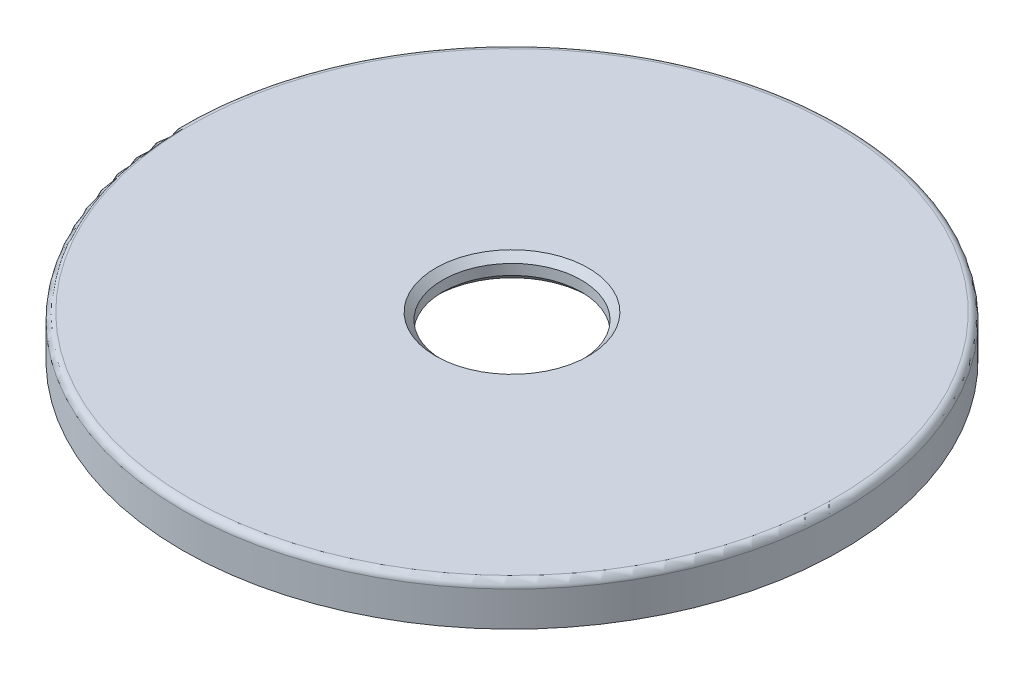
ISO-10303-21;
HEADER;
FILE_DESCRIPTION(('STEP AP214'),'2;1');
FILE_NAME('part.step','',(''),(''),'','','');
FILE_SCHEMA(('AUTOMOTIVE_DESIGN { 1 0 10303 214 1 1 1 1 }'));
ENDSEC;
DATA;
#1=APPLICATION_CONTEXT('core data for automotive mechanical design processes');
#2=APPLICATION_PROTOCOL_DEFINITION('international standard','automotive_design',2000,#1);
#3=PRODUCT_CONTEXT('',#1,'mechanical');
#4=PRODUCT('Part','Part','',(#3));
#5=PRODUCT_RELATED_PRODUCT_CATEGORY('part','',(#4));
#6=PRODUCT_DEFINITION_FORMATION('','',#4);
#7=PRODUCT_DEFINITION_CONTEXT('part definition',#1,'design');
#8=PRODUCT_DEFINITION('design','',#6,#7);
#9=PRODUCT_DEFINITION_SHAPE('','',#8);
#10=(LENGTH_UNIT() NAMED_UNIT(*) SI_UNIT(.MILLI.,.METRE.));
#11=(NAMED_UNIT(*) PLANE_ANGLE_UNIT() SI_UNIT($,.RADIAN.));
#12=(NAMED_UNIT(*) SI_UNIT($,.STERADIAN.) SOLID_ANGLE_UNIT());
#13=UNCERTAINTY_MEASURE_WITH_UNIT(LENGTH_MEASURE(1.E-05),#10,'distance_accuracy_value','');
#14=(GEOMETRIC_REPRESENTATION_CONTEXT(3) GLOBAL_UNCERTAINTY_ASSIGNED_CONTEXT((#13)) GLOBAL_UNIT_ASSIGNED_CONTEXT((#10,
#11,#12)) REPRESENTATION_CONTEXT('',''));
#15=CARTESIAN_POINT('',(0.,0.,0.));
#16=DIRECTION('',(0.,0.,1.));
#17=DIRECTION('',(1.,0.,0.));
#18=AXIS2_PLACEMENT_3D('',#15,#16,#17);
#19=CARTESIAN_POINT('',(0.,0.,0.));
#20=DIRECTION('',(0.,1.,0.));
#21=DIRECTION('',(0.,0.,1.));
#22=AXIS2_PLACEMENT_3D('',#19,#20,#21);
#23=PLANE('',#22);
#24=CARTESIAN_POINT('',(0.,0.,0.));
#25=DIRECTION('',(0.,-1.,0.));
#26=DIRECTION('',(0.,0.,-1.));
#27=AXIS2_PLACEMENT_3D('',#24,#25,#26);
#28=CIRCLE('',#27,42.5);
#29=CARTESIAN_POINT('',(0.,0.,-42.5));
#30=VERTEX_POINT('',#29);
#31=EDGE_CURVE('E63',#30,#30,#28,.T.);
#32=ORIENTED_EDGE('',*,*,#31,.F.);
#33=EDGE_LOOP('',(#32));
#34=FACE_BOUND('',#33,.T.);
#35=CARTESIAN_POINT('',(0.,0.,0.));
#36=DIRECTION('',(0.,-1.,0.));
#37=DIRECTION('',(0.,0.,-1.));
#38=AXIS2_PLACEMENT_3D('',#35,#36,#37);
#39=CIRCLE('',#38,45.6);
#40=CARTESIAN_POINT('',(0.,0.,-45.6));
#41=VERTEX_POINT('',#40);
#42=EDGE_CURVE('E73',#41,#41,#39,.T.);
#43=ORIENTED_EDGE('',*,*,#42,.T.);
#44=EDGE_LOOP('',(#43));
#45=FACE_BOUND('',#44,.T.);
#46=ADVANCED_FACE('F37',(#34,#45),#23,.F.);
#47=CARTESIAN_POINT('',(0.,2.,0.));
#48=DIRECTION('',(0.,-1.,0.));
#49=DIRECTION('',(0.,0.,-1.));
#50=AXIS2_PLACEMENT_3D('',#47,#48,#49);
#51=CYLINDRICAL_SURFACE('',#50,47.5);
#52=CARTESIAN_POINT('',(0.,1.,0.));
#53=DIRECTION('',(0.,1.,0.));
#54=DIRECTION('',(0.,0.,1.));
#55=AXIS2_PLACEMENT_3D('',#52,#53,#54);
#56=CIRCLE('',#55,47.5);
#57=CARTESIAN_POINT('',(0.,1.,47.5));
#58=VERTEX_POINT('',#57);
#59=EDGE_CURVE('E10',#58,#58,#56,.F.);
#60=ORIENTED_EDGE('',*,*,#59,.T.);
#61=EDGE_LOOP('',(#60));
#62=FACE_BOUND('',#61,.T.);
#63=CARTESIAN_POINT('',(0.,-4.,0.));
#64=DIRECTION('',(0.,-1.,0.));
#65=DIRECTION('',(0.,0.,-1.));
#66=AXIS2_PLACEMENT_3D('',#63,#64,#65);
#67=CIRCLE('',#66,47.5);
#68=CARTESIAN_POINT('',(0.,-4.,-47.5));
#69=VERTEX_POINT('',#68);
#70=EDGE_CURVE('E67',#69,#69,#67,.T.);
#71=ORIENTED_EDGE('',*,*,#70,.F.);
#72=EDGE_LOOP('',(#71));
#73=FACE_BOUND('',#72,.T.);
#74=ADVANCED_FACE('F96',(#62,#73),#51,.T.);
#75=CARTESIAN_POINT('',(0.,2.,0.));
#76=DIRECTION('',(0.,1.,0.));
#77=DIRECTION('',(0.,0.,1.));
#78=AXIS2_PLACEMENT_3D('',#75,#76,#77);
#79=PLANE('',#78);
#80=CARTESIAN_POINT('',(0.,2.,0.));
#81=DIRECTION('',(0.,1.,0.));
#82=DIRECTION('',(0.,0.,1.));
#83=AXIS2_PLACEMENT_3D('',#80,#81,#82);
#84=CIRCLE('',#83,46.5);
#85=CARTESIAN_POINT('',(0.,2.,46.5));
#86=VERTEX_POINT('',#85);
#87=EDGE_CURVE('E44',#86,#86,#84,.T.);
#88=ORIENTED_EDGE('',*,*,#87,.T.);
#89=EDGE_LOOP('',(#88));
#90=FACE_BOUND('',#89,.T.);
#91=CARTESIAN_POINT('',(0.,2.,0.));
#92=DIRECTION('',(0.,1.,0.));
#93=DIRECTION('',(0.,0.,1.));
#94=AXIS2_PLACEMENT_3D('',#91,#92,#93);
#95=CIRCLE('',#94,11.);
#96=CARTESIAN_POINT('',(0.,2.,11.));
#97=VERTEX_POINT('',#96);
#98=EDGE_CURVE('E48',#97,#97,#95,.F.);
#99=ORIENTED_EDGE('',*,*,#98,.T.);
#100=EDGE_LOOP('',(#99));
#101=FACE_BOUND('',#100,.T.);
#102=ADVANCED_FACE('F102',(#90,#101),#79,.T.);
#103=CARTESIAN_POINT('',(0.,0.,0.));
#104=DIRECTION('',(0.,1.,0.));
#105=DIRECTION('',(0.,0.,-1.));
#106=AXIS2_PLACEMENT_3D('',#103,#104,#105);
#107=CONICAL_SURFACE('',#106,42.5,0.0349065850398867);
#108=CARTESIAN_POINT('',(0.,-1.5,0.));
#109=DIRECTION('',(0.,-1.,0.));
#110=DIRECTION('',(0.,0.,-1.));
#111=AXIS2_PLACEMENT_3D('',#108,#109,#110);
#112=CIRCLE('',#111,42.4476188457624);
#113=CARTESIAN_POINT('',(0.,-1.5,-42.4476188457624));
#114=VERTEX_POINT('',#113);
#115=EDGE_CURVE('E64',#114,#114,#112,.T.);
#116=ORIENTED_EDGE('',*,*,#115,.F.);
#117=EDGE_LOOP('',(#116));
#118=FACE_BOUND('',#117,.T.);
#119=ORIENTED_EDGE('',*,*,#31,.T.);
#120=EDGE_LOOP('',(#119));
#121=FACE_BOUND('',#120,.T.);
#122=ADVANCED_FACE('F126',(#118,#121),#107,.T.);
#123=CARTESIAN_POINT('',(0.,-1.5,0.));
#124=DIRECTION('',(0.,-1.,0.));
#125=DIRECTION('',(0.,0.,-1.));
#126=AXIS2_PLACEMENT_3D('',#123,#124,#125);
#127=PLANE('',#126);
#128=CARTESIAN_POINT('',(0.,-1.5,0.));
#129=DIRECTION('',(0.,-1.,0.));
#130=DIRECTION('',(0.,0.,-1.));
#131=AXIS2_PLACEMENT_3D('',#128,#129,#130);
#132=CIRCLE('',#131,11.);
#133=CARTESIAN_POINT('',(0.,-1.5,-11.));
#134=VERTEX_POINT('',#133);
#135=EDGE_CURVE('E52',#134,#134,#132,.F.);
#136=ORIENTED_EDGE('',*,*,#135,.T.);
#137=EDGE_LOOP('',(#136));
#138=FACE_BOUND('',#137,.T.);
#139=ORIENTED_EDGE('',*,*,#115,.T.);
#140=EDGE_LOOP('',(#139));
#141=FACE_BOUND('',#140,.T.);
#142=ADVANCED_FACE('F115',(#138,#141),#127,.T.);
#143=CARTESIAN_POINT('',(0.,-2.,0.));
#144=DIRECTION('',(0.,1.,0.));
#145=DIRECTION('',(0.,0.,1.));
#146=AXIS2_PLACEMENT_3D('',#143,#144,#145);
#147=CYLINDRICAL_SURFACE('',#146,10.);
#148=CARTESIAN_POINT('',(0.,-0.500000000000025,0.));
#149=DIRECTION('',(0.,-1.,0.));
#150=DIRECTION('',(0.,0.,-1.));
#151=AXIS2_PLACEMENT_3D('',#148,#149,#150);
#152=CIRCLE('',#151,10.);
#153=CARTESIAN_POINT('',(0.,-0.500000000000025,-10.));
#154=VERTEX_POINT('',#153);
#155=EDGE_CURVE('E57',#154,#154,#152,.T.);
#156=ORIENTED_EDGE('',*,*,#155,.T.);
#157=EDGE_LOOP('',(#156));
#158=FACE_BOUND('',#157,.T.);
#159=CARTESIAN_POINT('',(0.,1.00000000000003,0.));
#160=DIRECTION('',(0.,1.,0.));
#161=DIRECTION('',(0.,0.,1.));
#162=AXIS2_PLACEMENT_3D('',#159,#160,#161);
#163=CIRCLE('',#162,10.);
#164=CARTESIAN_POINT('',(0.,1.00000000000003,10.));
#165=VERTEX_POINT('',#164);
#166=EDGE_CURVE('E60',#165,#165,#163,.T.);
#167=ORIENTED_EDGE('',*,*,#166,.T.);
#168=EDGE_LOOP('',(#167));
#169=FACE_BOUND('',#168,.T.);
#170=ADVANCED_FACE('F110',(#158,#169),#147,.F.);
#171=CARTESIAN_POINT('',(0.,-0.500000000000025,0.));
#172=DIRECTION('',(0.,-1.,0.));
#173=DIRECTION('',(0.,0.,-1.));
#174=AXIS2_PLACEMENT_3D('',#171,#172,#173);
#175=CONICAL_SURFACE('',#174,10.,0.785398163397452);
#176=ORIENTED_EDGE('',*,*,#135,.F.);
#177=EDGE_LOOP('',(#176));
#178=FACE_BOUND('',#177,.T.);
#179=ORIENTED_EDGE('',*,*,#155,.F.);
#180=EDGE_LOOP('',(#179));
#181=FACE_BOUND('',#180,.T.);
#182=ADVANCED_FACE('F92',(#178,#181),#175,.F.);
#183=CARTESIAN_POINT('',(0.,1.00000000000003,0.));
#184=DIRECTION('',(0.,1.,0.));
#185=DIRECTION('',(0.,0.,1.));
#186=AXIS2_PLACEMENT_3D('',#183,#184,#185);
#187=CONICAL_SURFACE('',#186,10.,0.785398163397452);
#188=ORIENTED_EDGE('',*,*,#98,.F.);
#189=EDGE_LOOP('',(#188));
#190=FACE_BOUND('',#189,.T.);
#191=ORIENTED_EDGE('',*,*,#166,.F.);
#192=EDGE_LOOP('',(#191));
#193=FACE_BOUND('',#192,.T.);
#194=ADVANCED_FACE('F84',(#190,#193),#187,.F.);
#195=CARTESIAN_POINT('',(0.,-4.,0.));
#196=DIRECTION('',(0.,-1.,0.));
#197=DIRECTION('',(0.,0.,-1.));
#198=AXIS2_PLACEMENT_3D('',#195,#196,#197);
#199=PLANE('',#198);
#200=ORIENTED_EDGE('',*,*,#70,.T.);
#201=EDGE_LOOP('',(#200));
#202=FACE_BOUND('',#201,.T.);
#203=CARTESIAN_POINT('',(0.,-4.,0.));
#204=DIRECTION('',(0.,-1.,0.));
#205=DIRECTION('',(0.,0.,-1.));
#206=AXIS2_PLACEMENT_3D('',#203,#204,#205);
#207=CIRCLE('',#206,45.6);
#208=CARTESIAN_POINT('',(0.,-4.,-45.6));
#209=VERTEX_POINT('',#208);
#210=EDGE_CURVE('E72',#209,#209,#207,.T.);
#211=ORIENTED_EDGE('',*,*,#210,.F.);
#212=EDGE_LOOP('',(#211));
#213=FACE_BOUND('',#212,.T.);
#214=ADVANCED_FACE('F82',(#202,#213),#199,.T.);
#215=CARTESIAN_POINT('',(0.,-4.,0.));
#216=DIRECTION('',(0.,1.,0.));
#217=DIRECTION('',(0.,0.,1.));
#218=AXIS2_PLACEMENT_3D('',#215,#216,#217);
#219=CYLINDRICAL_SURFACE('',#218,45.6);
#220=ORIENTED_EDGE('',*,*,#210,.T.);
#221=EDGE_LOOP('',(#220));
#222=FACE_BOUND('',#221,.T.);
#223=ORIENTED_EDGE('',*,*,#42,.F.);
#224=EDGE_LOOP('',(#223));
#225=FACE_BOUND('',#224,.T.);
#226=ADVANCED_FACE('F79',(#222,#225),#219,.F.);
#227=CARTESIAN_POINT('',(0.,1.,0.));
#228=DIRECTION('',(0.,1.,0.));
#229=DIRECTION('',(0.,0.,1.));
#230=AXIS2_PLACEMENT_3D('',#227,#228,#229);
#231=TOROIDAL_SURFACE('',#230,46.5,1.);
#232=ORIENTED_EDGE('',*,*,#59,.F.);
#233=EDGE_LOOP('',(#232));
#234=FACE_BOUND('',#233,.T.);
#235=ORIENTED_EDGE('',*,*,#87,.F.);
#236=EDGE_LOOP('',(#235));
#237=FACE_BOUND('',#236,.T.);
#238=ADVANCED_FACE('F39',(#234,#237),#231,.T.);
#239=CLOSED_SHELL('',(#46,#74,#102,#122,#142,#170,#182,#194,#214,#226,#238));
#240=MANIFOLD_SOLID_BREP('B2',#239);
#241=ADVANCED_BREP_SHAPE_REPRESENTATION('',(#18,#240),#14);
#242=SHAPE_DEFINITION_REPRESENTATION(#9,#241);
ENDSEC;
END-ISO-10303-21;
